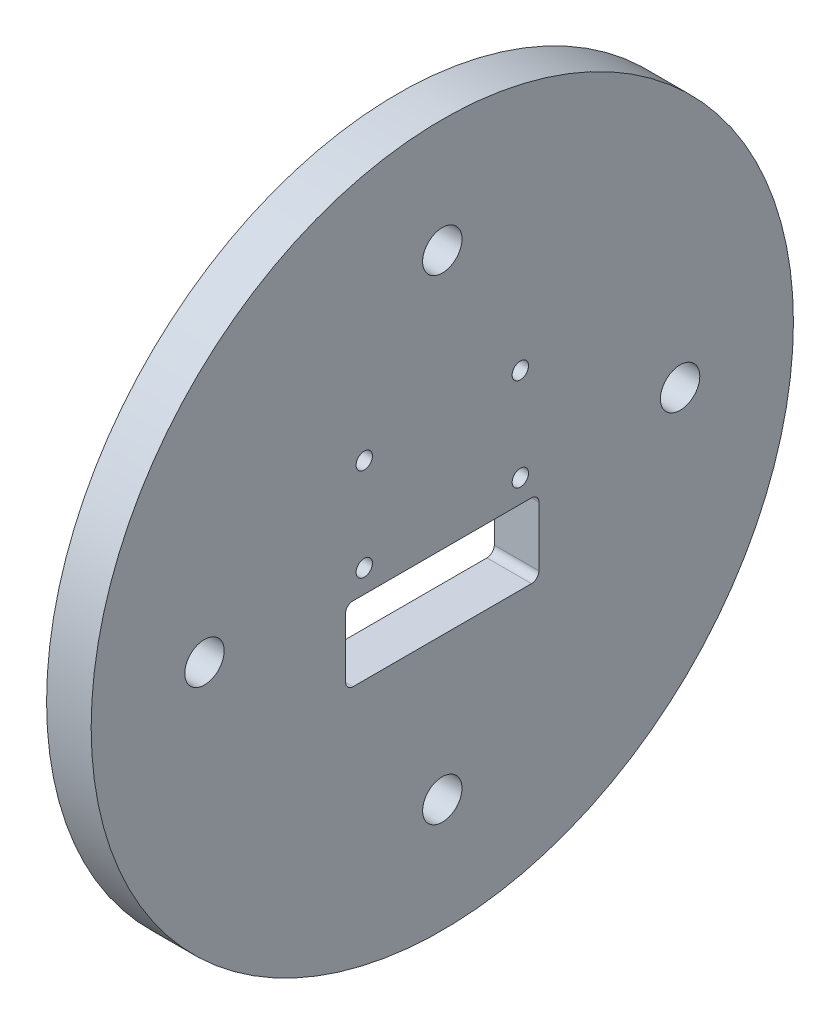
ISO-10303-21;
HEADER;
FILE_DESCRIPTION(('STEP AP214'),'2;1');
FILE_NAME('part.step','',(''),(''),'','','');
FILE_SCHEMA(('AUTOMOTIVE_DESIGN { 1 0 10303 214 1 1 1 1 }'));
ENDSEC;
DATA;
#1=APPLICATION_CONTEXT('core data for automotive mechanical design processes');
#2=APPLICATION_PROTOCOL_DEFINITION('international standard','automotive_design',2000,#1);
#3=PRODUCT_CONTEXT('',#1,'mechanical');
#4=PRODUCT('Part','Part','',(#3));
#5=PRODUCT_RELATED_PRODUCT_CATEGORY('part','',(#4));
#6=PRODUCT_DEFINITION_FORMATION('','',#4);
#7=PRODUCT_DEFINITION_CONTEXT('part definition',#1,'design');
#8=PRODUCT_DEFINITION('design','',#6,#7);
#9=PRODUCT_DEFINITION_SHAPE('','',#8);
#10=(LENGTH_UNIT() NAMED_UNIT(*) SI_UNIT(.MILLI.,.METRE.));
#11=(NAMED_UNIT(*) PLANE_ANGLE_UNIT() SI_UNIT($,.RADIAN.));
#12=(NAMED_UNIT(*) SI_UNIT($,.STERADIAN.) SOLID_ANGLE_UNIT());
#13=UNCERTAINTY_MEASURE_WITH_UNIT(LENGTH_MEASURE(1.E-05),#10,'distance_accuracy_value','');
#14=(GEOMETRIC_REPRESENTATION_CONTEXT(3) GLOBAL_UNCERTAINTY_ASSIGNED_CONTEXT((#13)) GLOBAL_UNIT_ASSIGNED_CONTEXT((#10,
#11,#12)) REPRESENTATION_CONTEXT('',''));
#15=CARTESIAN_POINT('',(0.,0.,0.));
#16=DIRECTION('',(0.,0.,1.));
#17=DIRECTION('',(1.,0.,0.));
#18=AXIS2_PLACEMENT_3D('',#15,#16,#17);
#19=CARTESIAN_POINT('',(6.,0.,0.));
#20=DIRECTION('',(-1.,0.,0.));
#21=DIRECTION('',(0.,0.,1.));
#22=AXIS2_PLACEMENT_3D('',#19,#20,#21);
#23=CYLINDRICAL_SURFACE('',#22,47.25);
#24=CARTESIAN_POINT('',(6.,0.,0.));
#25=DIRECTION('',(1.,0.,0.));
#26=DIRECTION('',(0.,0.,-1.));
#27=AXIS2_PLACEMENT_3D('',#24,#25,#26);
#28=CIRCLE('',#27,47.25);
#29=CARTESIAN_POINT('',(6.,0.,-47.25));
#30=VERTEX_POINT('',#29);
#31=EDGE_CURVE('E151',#30,#30,#28,.T.);
#32=ORIENTED_EDGE('',*,*,#31,.F.);
#33=EDGE_LOOP('',(#32));
#34=FACE_BOUND('',#33,.T.);
#35=CARTESIAN_POINT('',(0.,0.,0.));
#36=DIRECTION('',(1.,0.,0.));
#37=DIRECTION('',(0.,0.,-1.));
#38=AXIS2_PLACEMENT_3D('',#35,#36,#37);
#39=CIRCLE('',#38,47.25);
#40=CARTESIAN_POINT('',(0.,0.,-47.25));
#41=VERTEX_POINT('',#40);
#42=EDGE_CURVE('E140',#41,#41,#39,.T.);
#43=ORIENTED_EDGE('',*,*,#42,.T.);
#44=EDGE_LOOP('',(#43));
#45=FACE_BOUND('',#44,.T.);
#46=ADVANCED_FACE('F37',(#34,#45),#23,.T.);
#47=CARTESIAN_POINT('',(6.,0.,0.));
#48=DIRECTION('',(1.,0.,0.));
#49=DIRECTION('',(0.,0.,-1.));
#50=AXIS2_PLACEMENT_3D('',#47,#48,#49);
#51=PLANE('',#50);
#52=CARTESIAN_POINT('',(6.,0.,32.));
#53=DIRECTION('',(1.,0.,0.));
#54=DIRECTION('',(0.,0.,-1.));
#55=AXIS2_PLACEMENT_3D('',#52,#53,#54);
#56=CIRCLE('',#55,2.64999999999999);
#57=CARTESIAN_POINT('',(6.,0.,29.35));
#58=VERTEX_POINT('',#57);
#59=EDGE_CURVE('E206',#58,#58,#56,.T.);
#60=ORIENTED_EDGE('',*,*,#59,.F.);
#61=EDGE_LOOP('',(#60));
#62=FACE_BOUND('',#61,.T.);
#63=CARTESIAN_POINT('',(6.,32.,0.));
#64=DIRECTION('',(1.,0.,0.));
#65=DIRECTION('',(0.,0.,-1.));
#66=AXIS2_PLACEMENT_3D('',#63,#64,#65);
#67=CIRCLE('',#66,2.64999999999999);
#68=CARTESIAN_POINT('',(6.,32.,-2.64999999999998));
#69=VERTEX_POINT('',#68);
#70=EDGE_CURVE('E196',#69,#69,#67,.T.);
#71=ORIENTED_EDGE('',*,*,#70,.F.);
#72=EDGE_LOOP('',(#71));
#73=FACE_BOUND('',#72,.T.);
#74=CARTESIAN_POINT('',(6.,0.,-32.));
#75=DIRECTION('',(1.,0.,0.));
#76=DIRECTION('',(0.,0.,-1.));
#77=AXIS2_PLACEMENT_3D('',#74,#75,#76);
#78=CIRCLE('',#77,2.64999999999999);
#79=CARTESIAN_POINT('',(6.,0.,-34.65));
#80=VERTEX_POINT('',#79);
#81=EDGE_CURVE('E193',#80,#80,#78,.T.);
#82=ORIENTED_EDGE('',*,*,#81,.F.);
#83=EDGE_LOOP('',(#82));
#84=FACE_BOUND('',#83,.T.);
#85=CARTESIAN_POINT('',(6.,-32.,0.));
#86=DIRECTION('',(1.,0.,0.));
#87=DIRECTION('',(0.,0.,-1.));
#88=AXIS2_PLACEMENT_3D('',#85,#86,#87);
#89=CIRCLE('',#88,2.64999999999999);
#90=CARTESIAN_POINT('',(6.,-32.,-2.64999999999999));
#91=VERTEX_POINT('',#90);
#92=EDGE_CURVE('E190',#91,#91,#89,.T.);
#93=ORIENTED_EDGE('',*,*,#92,.F.);
#94=EDGE_LOOP('',(#93));
#95=FACE_BOUND('',#94,.T.);
#96=CARTESIAN_POINT('',(6.,12.75,10.5));
#97=DIRECTION('',(1.,0.,0.));
#98=DIRECTION('',(0.,0.,-1.));
#99=AXIS2_PLACEMENT_3D('',#96,#97,#98);
#100=CIRCLE('',#99,1.1);
#101=CARTESIAN_POINT('',(6.,12.75,9.40000000000001));
#102=VERTEX_POINT('',#101);
#103=EDGE_CURVE('E186',#102,#102,#100,.T.);
#104=ORIENTED_EDGE('',*,*,#103,.F.);
#105=EDGE_LOOP('',(#104));
#106=FACE_BOUND('',#105,.T.);
#107=CARTESIAN_POINT('',(6.,12.75,-10.5));
#108=DIRECTION('',(1.,0.,0.));
#109=DIRECTION('',(0.,0.,-1.));
#110=AXIS2_PLACEMENT_3D('',#107,#108,#109);
#111=CIRCLE('',#110,1.10000000000001);
#112=CARTESIAN_POINT('',(6.,12.75,-11.6));
#113=VERTEX_POINT('',#112);
#114=EDGE_CURVE('E182',#113,#113,#111,.T.);
#115=ORIENTED_EDGE('',*,*,#114,.F.);
#116=EDGE_LOOP('',(#115));
#117=FACE_BOUND('',#116,.T.);
#118=CARTESIAN_POINT('',(6.,0.250000000000007,-10.5));
#119=DIRECTION('',(1.,0.,0.));
#120=DIRECTION('',(0.,0.,-1.));
#121=AXIS2_PLACEMENT_3D('',#118,#119,#120);
#122=CIRCLE('',#121,1.10000000000001);
#123=CARTESIAN_POINT('',(6.,0.250000000000007,-11.6));
#124=VERTEX_POINT('',#123);
#125=EDGE_CURVE('E178',#124,#124,#122,.T.);
#126=ORIENTED_EDGE('',*,*,#125,.F.);
#127=EDGE_LOOP('',(#126));
#128=FACE_BOUND('',#127,.T.);
#129=CARTESIAN_POINT('',(6.,0.250000000000007,10.5));
#130=DIRECTION('',(1.,0.,0.));
#131=DIRECTION('',(0.,0.,-1.));
#132=AXIS2_PLACEMENT_3D('',#129,#130,#131);
#133=CIRCLE('',#132,1.1);
#134=CARTESIAN_POINT('',(6.,0.250000000000007,9.40000000000001));
#135=VERTEX_POINT('',#134);
#136=EDGE_CURVE('E174',#135,#135,#133,.T.);
#137=ORIENTED_EDGE('',*,*,#136,.F.);
#138=EDGE_LOOP('',(#137));
#139=FACE_BOUND('',#138,.T.);
#140=CARTESIAN_POINT('',(6.,-11.85,12.));
#141=DIRECTION('',(1.,0.,0.));
#142=DIRECTION('',(0.,0.,-1.));
#143=AXIS2_PLACEMENT_3D('',#140,#141,#142);
#144=CIRCLE('',#143,1.);
#145=CARTESIAN_POINT('',(6.,-12.85,12.));
#146=VERTEX_POINT('',#145);
#147=CARTESIAN_POINT('',(6.,-11.85,13.));
#148=VERTEX_POINT('',#147);
#149=EDGE_CURVE('E114',#146,#148,#144,.F.);
#150=ORIENTED_EDGE('',*,*,#149,.T.);
#151=DIRECTION('',(0.,1.,0.));
#152=VECTOR('',#151,1.);
#153=CARTESIAN_POINT('',(6.,0.,13.));
#154=LINE('',#153,#152);
#155=CARTESIAN_POINT('',(6.,-4.10000000000001,13.));
#156=VERTEX_POINT('',#155);
#157=EDGE_CURVE('E53',#148,#156,#154,.T.);
#158=ORIENTED_EDGE('',*,*,#157,.T.);
#159=CARTESIAN_POINT('',(6.,-3.84949152518986,12.0318855935127));
#160=DIRECTION('',(1.,0.,0.));
#161=DIRECTION('',(0.,0.,-1.));
#162=AXIS2_PLACEMENT_3D('',#159,#160,#161);
#163=CIRCLE('',#162,1.);
#164=CARTESIAN_POINT('',(6.,-2.85,12.));
#165=VERTEX_POINT('',#164);
#166=EDGE_CURVE('E135',#165,#156,#163,.T.);
#167=ORIENTED_EDGE('',*,*,#166,.F.);
#168=DIRECTION('',(0.,0.,-1.));
#169=VECTOR('',#168,1.);
#170=CARTESIAN_POINT('',(6.,-2.85,0.));
#171=LINE('',#170,#169);
#172=CARTESIAN_POINT('',(6.,-2.85,-12.));
#173=VERTEX_POINT('',#172);
#174=EDGE_CURVE('E132',#165,#173,#171,.T.);
#175=ORIENTED_EDGE('',*,*,#174,.T.);
#176=CARTESIAN_POINT('',(6.,-3.85,-12.));
#177=DIRECTION('',(1.,0.,0.));
#178=DIRECTION('',(0.,0.,-1.));
#179=AXIS2_PLACEMENT_3D('',#176,#177,#178);
#180=CIRCLE('',#179,0.999999999999999);
#181=CARTESIAN_POINT('',(6.,-3.85000000000001,-13.));
#182=VERTEX_POINT('',#181);
#183=EDGE_CURVE('E129',#182,#173,#180,.T.);
#184=ORIENTED_EDGE('',*,*,#183,.F.);
#185=DIRECTION('',(0.,-1.,0.));
#186=VECTOR('',#185,1.);
#187=CARTESIAN_POINT('',(6.,0.,-13.));
#188=LINE('',#187,#186);
#189=CARTESIAN_POINT('',(6.,-11.85,-13.));
#190=VERTEX_POINT('',#189);
#191=EDGE_CURVE('E124',#182,#190,#188,.T.);
#192=ORIENTED_EDGE('',*,*,#191,.T.);
#193=CARTESIAN_POINT('',(6.,-11.85,-12.));
#194=DIRECTION('',(1.,0.,0.));
#195=DIRECTION('',(0.,0.,-1.));
#196=AXIS2_PLACEMENT_3D('',#193,#194,#195);
#197=CIRCLE('',#196,1.);
#198=CARTESIAN_POINT('',(6.,-12.85,-12.));
#199=VERTEX_POINT('',#198);
#200=EDGE_CURVE('E122',#199,#190,#197,.T.);
#201=ORIENTED_EDGE('',*,*,#200,.F.);
#202=DIRECTION('',(0.,0.,1.));
#203=VECTOR('',#202,1.);
#204=CARTESIAN_POINT('',(6.,-12.85,0.));
#205=LINE('',#204,#203);
#206=EDGE_CURVE('E105',#199,#146,#205,.T.);
#207=ORIENTED_EDGE('',*,*,#206,.T.);
#208=EDGE_LOOP('',(#150,#158,#167,#175,#184,#192,#201,#207));
#209=FACE_BOUND('',#208,.T.);
#210=ORIENTED_EDGE('',*,*,#31,.T.);
#211=EDGE_LOOP('',(#210));
#212=FACE_BOUND('',#211,.T.);
#213=ADVANCED_FACE('F118',(#62,#73,#84,#95,#106,#117,#128,#139,#209,#212),#51,.T.);
#214=CARTESIAN_POINT('',(0.,0.,0.));
#215=DIRECTION('',(1.,0.,0.));
#216=DIRECTION('',(0.,0.,-1.));
#217=AXIS2_PLACEMENT_3D('',#214,#215,#216);
#218=PLANE('',#217);
#219=CARTESIAN_POINT('',(0.,0.,32.));
#220=DIRECTION('',(1.,0.,0.));
#221=DIRECTION('',(0.,0.,-1.));
#222=AXIS2_PLACEMENT_3D('',#219,#220,#221);
#223=CIRCLE('',#222,2.64999999999999);
#224=CARTESIAN_POINT('',(0.,0.,29.35));
#225=VERTEX_POINT('',#224);
#226=EDGE_CURVE('E40',#225,#225,#223,.T.);
#227=ORIENTED_EDGE('',*,*,#226,.T.);
#228=EDGE_LOOP('',(#227));
#229=FACE_BOUND('',#228,.T.);
#230=CARTESIAN_POINT('',(0.,32.,0.));
#231=DIRECTION('',(1.,0.,0.));
#232=DIRECTION('',(0.,0.,-1.));
#233=AXIS2_PLACEMENT_3D('',#230,#231,#232);
#234=CIRCLE('',#233,2.64999999999999);
#235=CARTESIAN_POINT('',(0.,32.,-2.64999999999998));
#236=VERTEX_POINT('',#235);
#237=EDGE_CURVE('E194',#236,#236,#234,.T.);
#238=ORIENTED_EDGE('',*,*,#237,.T.);
#239=EDGE_LOOP('',(#238));
#240=FACE_BOUND('',#239,.T.);
#241=CARTESIAN_POINT('',(0.,0.,-32.));
#242=DIRECTION('',(1.,0.,0.));
#243=DIRECTION('',(0.,0.,-1.));
#244=AXIS2_PLACEMENT_3D('',#241,#242,#243);
#245=CIRCLE('',#244,2.64999999999999);
#246=CARTESIAN_POINT('',(0.,0.,-34.65));
#247=VERTEX_POINT('',#246);
#248=EDGE_CURVE('E191',#247,#247,#245,.T.);
#249=ORIENTED_EDGE('',*,*,#248,.T.);
#250=EDGE_LOOP('',(#249));
#251=FACE_BOUND('',#250,.T.);
#252=CARTESIAN_POINT('',(0.,-32.,0.));
#253=DIRECTION('',(1.,0.,0.));
#254=DIRECTION('',(0.,0.,-1.));
#255=AXIS2_PLACEMENT_3D('',#252,#253,#254);
#256=CIRCLE('',#255,2.64999999999999);
#257=CARTESIAN_POINT('',(0.,-32.,-2.64999999999999));
#258=VERTEX_POINT('',#257);
#259=EDGE_CURVE('E187',#258,#258,#256,.T.);
#260=ORIENTED_EDGE('',*,*,#259,.T.);
#261=EDGE_LOOP('',(#260));
#262=FACE_BOUND('',#261,.T.);
#263=CARTESIAN_POINT('',(0.,12.75,10.5));
#264=DIRECTION('',(1.,0.,0.));
#265=DIRECTION('',(0.,0.,-1.));
#266=AXIS2_PLACEMENT_3D('',#263,#264,#265);
#267=CIRCLE('',#266,1.1);
#268=CARTESIAN_POINT('',(0.,12.75,9.40000000000001));
#269=VERTEX_POINT('',#268);
#270=EDGE_CURVE('E183',#269,#269,#267,.T.);
#271=ORIENTED_EDGE('',*,*,#270,.T.);
#272=EDGE_LOOP('',(#271));
#273=FACE_BOUND('',#272,.T.);
#274=CARTESIAN_POINT('',(0.,12.75,-10.5));
#275=DIRECTION('',(1.,0.,0.));
#276=DIRECTION('',(0.,0.,-1.));
#277=AXIS2_PLACEMENT_3D('',#274,#275,#276);
#278=CIRCLE('',#277,1.10000000000001);
#279=CARTESIAN_POINT('',(0.,12.75,-11.6));
#280=VERTEX_POINT('',#279);
#281=EDGE_CURVE('E179',#280,#280,#278,.T.);
#282=ORIENTED_EDGE('',*,*,#281,.T.);
#283=EDGE_LOOP('',(#282));
#284=FACE_BOUND('',#283,.T.);
#285=CARTESIAN_POINT('',(0.,0.250000000000007,-10.5));
#286=DIRECTION('',(1.,0.,0.));
#287=DIRECTION('',(0.,0.,-1.));
#288=AXIS2_PLACEMENT_3D('',#285,#286,#287);
#289=CIRCLE('',#288,1.10000000000001);
#290=CARTESIAN_POINT('',(0.,0.250000000000007,-11.6));
#291=VERTEX_POINT('',#290);
#292=EDGE_CURVE('E175',#291,#291,#289,.T.);
#293=ORIENTED_EDGE('',*,*,#292,.T.);
#294=EDGE_LOOP('',(#293));
#295=FACE_BOUND('',#294,.T.);
#296=CARTESIAN_POINT('',(0.,0.250000000000007,10.5));
#297=DIRECTION('',(1.,0.,0.));
#298=DIRECTION('',(0.,0.,-1.));
#299=AXIS2_PLACEMENT_3D('',#296,#297,#298);
#300=CIRCLE('',#299,1.1);
#301=CARTESIAN_POINT('',(0.,0.250000000000007,9.40000000000001));
#302=VERTEX_POINT('',#301);
#303=EDGE_CURVE('E171',#302,#302,#300,.T.);
#304=ORIENTED_EDGE('',*,*,#303,.T.);
#305=EDGE_LOOP('',(#304));
#306=FACE_BOUND('',#305,.T.);
#307=DIRECTION('',(0.,1.,0.));
#308=VECTOR('',#307,1.);
#309=CARTESIAN_POINT('',(0.,0.,13.));
#310=LINE('',#309,#308);
#311=CARTESIAN_POINT('',(0.,-11.85,13.));
#312=VERTEX_POINT('',#311);
#313=CARTESIAN_POINT('',(0.,-4.10000000000001,13.));
#314=VERTEX_POINT('',#313);
#315=EDGE_CURVE('E11',#312,#314,#310,.T.);
#316=ORIENTED_EDGE('',*,*,#315,.F.);
#317=CARTESIAN_POINT('',(0.,-11.85,12.));
#318=DIRECTION('',(1.,0.,0.));
#319=DIRECTION('',(0.,0.,-1.));
#320=AXIS2_PLACEMENT_3D('',#317,#318,#319);
#321=CIRCLE('',#320,1.);
#322=CARTESIAN_POINT('',(0.,-12.85,12.));
#323=VERTEX_POINT('',#322);
#324=EDGE_CURVE('E154',#323,#312,#321,.F.);
#325=ORIENTED_EDGE('',*,*,#324,.F.);
#326=DIRECTION('',(0.,0.,1.));
#327=VECTOR('',#326,1.);
#328=CARTESIAN_POINT('',(0.,-12.85,0.));
#329=LINE('',#328,#327);
#330=CARTESIAN_POINT('',(0.,-12.85,-12.));
#331=VERTEX_POINT('',#330);
#332=EDGE_CURVE('E108',#331,#323,#329,.T.);
#333=ORIENTED_EDGE('',*,*,#332,.F.);
#334=CARTESIAN_POINT('',(0.,-11.85,-12.));
#335=DIRECTION('',(1.,0.,0.));
#336=DIRECTION('',(0.,0.,-1.));
#337=AXIS2_PLACEMENT_3D('',#334,#335,#336);
#338=CIRCLE('',#337,1.);
#339=CARTESIAN_POINT('',(0.,-11.85,-13.));
#340=VERTEX_POINT('',#339);
#341=EDGE_CURVE('E159',#331,#340,#338,.T.);
#342=ORIENTED_EDGE('',*,*,#341,.T.);
#343=DIRECTION('',(0.,-1.,0.));
#344=VECTOR('',#343,1.);
#345=CARTESIAN_POINT('',(0.,0.,-13.));
#346=LINE('',#345,#344);
#347=CARTESIAN_POINT('',(0.,-3.85000000000001,-13.));
#348=VERTEX_POINT('',#347);
#349=EDGE_CURVE('E162',#348,#340,#346,.T.);
#350=ORIENTED_EDGE('',*,*,#349,.F.);
#351=CARTESIAN_POINT('',(0.,-3.85,-12.));
#352=DIRECTION('',(1.,0.,0.));
#353=DIRECTION('',(0.,0.,-1.));
#354=AXIS2_PLACEMENT_3D('',#351,#352,#353);
#355=CIRCLE('',#354,0.999999999999999);
#356=CARTESIAN_POINT('',(0.,-2.85,-12.));
#357=VERTEX_POINT('',#356);
#358=EDGE_CURVE('E164',#348,#357,#355,.T.);
#359=ORIENTED_EDGE('',*,*,#358,.T.);
#360=DIRECTION('',(0.,0.,-1.));
#361=VECTOR('',#360,1.);
#362=CARTESIAN_POINT('',(0.,-2.85,0.));
#363=LINE('',#362,#361);
#364=CARTESIAN_POINT('',(0.,-2.85,12.));
#365=VERTEX_POINT('',#364);
#366=EDGE_CURVE('E167',#365,#357,#363,.T.);
#367=ORIENTED_EDGE('',*,*,#366,.F.);
#368=CARTESIAN_POINT('',(0.,-3.84949152518986,12.0318855935127));
#369=DIRECTION('',(1.,0.,0.));
#370=DIRECTION('',(0.,0.,-1.));
#371=AXIS2_PLACEMENT_3D('',#368,#369,#370);
#372=CIRCLE('',#371,1.);
#373=EDGE_CURVE('E45',#365,#314,#372,.T.);
#374=ORIENTED_EDGE('',*,*,#373,.T.);
#375=EDGE_LOOP('',(#316,#325,#333,#342,#350,#359,#367,#374));
#376=FACE_BOUND('',#375,.T.);
#377=ORIENTED_EDGE('',*,*,#42,.F.);
#378=EDGE_LOOP('',(#377));
#379=FACE_BOUND('',#378,.T.);
#380=ADVANCED_FACE('F241',(#229,#240,#251,#262,#273,#284,#295,#306,#376,#379),#218,.F.);
#381=CARTESIAN_POINT('',(-14.,0.,13.));
#382=DIRECTION('',(0.,0.,-1.));
#383=DIRECTION('',(-1.,0.,0.));
#384=AXIS2_PLACEMENT_3D('',#381,#382,#383);
#385=PLANE('',#384);
#386=ORIENTED_EDGE('',*,*,#315,.T.);
#387=DIRECTION('',(1.,0.,0.));
#388=VECTOR('',#387,1.);
#389=CARTESIAN_POINT('',(-14.,-4.10000000000001,13.));
#390=LINE('',#389,#388);
#391=EDGE_CURVE('E138',#314,#156,#390,.T.);
#392=ORIENTED_EDGE('',*,*,#391,.T.);
#393=ORIENTED_EDGE('',*,*,#157,.F.);
#394=DIRECTION('',(1.,0.,0.));
#395=VECTOR('',#394,1.);
#396=CARTESIAN_POINT('',(-14.,-11.85,13.));
#397=LINE('',#396,#395);
#398=EDGE_CURVE('E111',#312,#148,#397,.T.);
#399=ORIENTED_EDGE('',*,*,#398,.F.);
#400=EDGE_LOOP('',(#386,#392,#393,#399));
#401=FACE_BOUND('',#400,.T.);
#402=ADVANCED_FACE('F243',(#401),#385,.T.);
#403=CARTESIAN_POINT('',(-14.,-3.84949152518986,12.0318855935127));
#404=DIRECTION('',(1.,0.,0.));
#405=DIRECTION('',(0.,0.,-1.));
#406=AXIS2_PLACEMENT_3D('',#403,#404,#405);
#407=CYLINDRICAL_SURFACE('',#406,1.);
#408=DIRECTION('',(1.,0.,0.));
#409=VECTOR('',#408,1.);
#410=CARTESIAN_POINT('',(-14.,-2.85,12.));
#411=LINE('',#410,#409);
#412=EDGE_CURVE('E141',#365,#165,#411,.T.);
#413=ORIENTED_EDGE('',*,*,#412,.T.);
#414=ORIENTED_EDGE('',*,*,#166,.T.);
#415=ORIENTED_EDGE('',*,*,#391,.F.);
#416=ORIENTED_EDGE('',*,*,#373,.F.);
#417=EDGE_LOOP('',(#413,#414,#415,#416));
#418=FACE_BOUND('',#417,.T.);
#419=ADVANCED_FACE('F223',(#418),#407,.F.);
#420=CARTESIAN_POINT('',(-14.,-2.85,0.));
#421=DIRECTION('',(0.,-1.,0.));
#422=DIRECTION('',(0.,0.,-1.));
#423=AXIS2_PLACEMENT_3D('',#420,#421,#422);
#424=PLANE('',#423);
#425=ORIENTED_EDGE('',*,*,#366,.T.);
#426=DIRECTION('',(1.,0.,0.));
#427=VECTOR('',#426,1.);
#428=CARTESIAN_POINT('',(-14.,-2.85,-12.));
#429=LINE('',#428,#427);
#430=EDGE_CURVE('E143',#357,#173,#429,.T.);
#431=ORIENTED_EDGE('',*,*,#430,.T.);
#432=ORIENTED_EDGE('',*,*,#174,.F.);
#433=ORIENTED_EDGE('',*,*,#412,.F.);
#434=EDGE_LOOP('',(#425,#431,#432,#433));
#435=FACE_BOUND('',#434,.T.);
#436=ADVANCED_FACE('F227',(#435),#424,.T.);
#437=CARTESIAN_POINT('',(-14.,-3.85,-12.));
#438=DIRECTION('',(1.,0.,0.));
#439=DIRECTION('',(0.,0.,-1.));
#440=AXIS2_PLACEMENT_3D('',#437,#438,#439);
#441=CYLINDRICAL_SURFACE('',#440,0.999999999999999);
#442=DIRECTION('',(1.,0.,0.));
#443=VECTOR('',#442,1.);
#444=CARTESIAN_POINT('',(-14.,-3.85000000000001,-13.));
#445=LINE('',#444,#443);
#446=EDGE_CURVE('E145',#348,#182,#445,.T.);
#447=ORIENTED_EDGE('',*,*,#446,.T.);
#448=ORIENTED_EDGE('',*,*,#183,.T.);
#449=ORIENTED_EDGE('',*,*,#430,.F.);
#450=ORIENTED_EDGE('',*,*,#358,.F.);
#451=EDGE_LOOP('',(#447,#448,#449,#450));
#452=FACE_BOUND('',#451,.T.);
#453=ADVANCED_FACE('F230',(#452),#441,.F.);
#454=CARTESIAN_POINT('',(-14.,0.,-13.));
#455=DIRECTION('',(0.,0.,1.));
#456=DIRECTION('',(0.,-1.,0.));
#457=AXIS2_PLACEMENT_3D('',#454,#455,#456);
#458=PLANE('',#457);
#459=ORIENTED_EDGE('',*,*,#349,.T.);
#460=DIRECTION('',(1.,0.,0.));
#461=VECTOR('',#460,1.);
#462=CARTESIAN_POINT('',(-14.,-11.85,-13.));
#463=LINE('',#462,#461);
#464=EDGE_CURVE('E147',#340,#190,#463,.T.);
#465=ORIENTED_EDGE('',*,*,#464,.T.);
#466=ORIENTED_EDGE('',*,*,#191,.F.);
#467=ORIENTED_EDGE('',*,*,#446,.F.);
#468=EDGE_LOOP('',(#459,#465,#466,#467));
#469=FACE_BOUND('',#468,.T.);
#470=ADVANCED_FACE('F234',(#469),#458,.T.);
#471=CARTESIAN_POINT('',(-14.,-11.85,-12.));
#472=DIRECTION('',(1.,0.,0.));
#473=DIRECTION('',(0.,0.,-1.));
#474=AXIS2_PLACEMENT_3D('',#471,#472,#473);
#475=CYLINDRICAL_SURFACE('',#474,1.);
#476=DIRECTION('',(1.,0.,0.));
#477=VECTOR('',#476,1.);
#478=CARTESIAN_POINT('',(-14.,-12.85,-12.));
#479=LINE('',#478,#477);
#480=EDGE_CURVE('E110',#331,#199,#479,.T.);
#481=ORIENTED_EDGE('',*,*,#480,.T.);
#482=ORIENTED_EDGE('',*,*,#200,.T.);
#483=ORIENTED_EDGE('',*,*,#464,.F.);
#484=ORIENTED_EDGE('',*,*,#341,.F.);
#485=EDGE_LOOP('',(#481,#482,#483,#484));
#486=FACE_BOUND('',#485,.T.);
#487=ADVANCED_FACE('F238',(#486),#475,.F.);
#488=CARTESIAN_POINT('',(-14.,-12.85,0.));
#489=DIRECTION('',(0.,1.,0.));
#490=DIRECTION('',(0.,0.,1.));
#491=AXIS2_PLACEMENT_3D('',#488,#489,#490);
#492=PLANE('',#491);
#493=ORIENTED_EDGE('',*,*,#332,.T.);
#494=DIRECTION('',(1.,0.,0.));
#495=VECTOR('',#494,1.);
#496=CARTESIAN_POINT('',(-14.,-12.85,12.));
#497=LINE('',#496,#495);
#498=EDGE_CURVE('E61',#323,#146,#497,.T.);
#499=ORIENTED_EDGE('',*,*,#498,.T.);
#500=ORIENTED_EDGE('',*,*,#206,.F.);
#501=ORIENTED_EDGE('',*,*,#480,.F.);
#502=EDGE_LOOP('',(#493,#499,#500,#501));
#503=FACE_BOUND('',#502,.T.);
#504=ADVANCED_FACE('F102',(#503),#492,.T.);
#505=CARTESIAN_POINT('',(-14.,-11.85,12.));
#506=DIRECTION('',(1.,0.,0.));
#507=DIRECTION('',(0.,0.,-1.));
#508=AXIS2_PLACEMENT_3D('',#505,#506,#507);
#509=CYLINDRICAL_SURFACE('',#508,1.);
#510=ORIENTED_EDGE('',*,*,#324,.T.);
#511=ORIENTED_EDGE('',*,*,#398,.T.);
#512=ORIENTED_EDGE('',*,*,#149,.F.);
#513=ORIENTED_EDGE('',*,*,#498,.F.);
#514=EDGE_LOOP('',(#510,#511,#512,#513));
#515=FACE_BOUND('',#514,.T.);
#516=ADVANCED_FACE('F115',(#515),#509,.F.);
#517=CARTESIAN_POINT('',(-14.,0.250000000000007,10.5));
#518=DIRECTION('',(1.,0.,0.));
#519=DIRECTION('',(0.,0.,-1.));
#520=AXIS2_PLACEMENT_3D('',#517,#518,#519);
#521=CYLINDRICAL_SURFACE('',#520,1.1);
#522=ORIENTED_EDGE('',*,*,#136,.T.);
#523=EDGE_LOOP('',(#522));
#524=FACE_BOUND('',#523,.T.);
#525=ORIENTED_EDGE('',*,*,#303,.F.);
#526=EDGE_LOOP('',(#525));
#527=FACE_BOUND('',#526,.T.);
#528=ADVANCED_FACE('F281',(#524,#527),#521,.F.);
#529=CARTESIAN_POINT('',(-14.,0.250000000000007,-10.5));
#530=DIRECTION('',(1.,0.,0.));
#531=DIRECTION('',(0.,0.,-1.));
#532=AXIS2_PLACEMENT_3D('',#529,#530,#531);
#533=CYLINDRICAL_SURFACE('',#532,1.10000000000001);
#534=ORIENTED_EDGE('',*,*,#125,.T.);
#535=EDGE_LOOP('',(#534));
#536=FACE_BOUND('',#535,.T.);
#537=ORIENTED_EDGE('',*,*,#292,.F.);
#538=EDGE_LOOP('',(#537));
#539=FACE_BOUND('',#538,.T.);
#540=ADVANCED_FACE('F284',(#536,#539),#533,.F.);
#541=CARTESIAN_POINT('',(-14.,12.75,-10.5));
#542=DIRECTION('',(1.,0.,0.));
#543=DIRECTION('',(0.,0.,-1.));
#544=AXIS2_PLACEMENT_3D('',#541,#542,#543);
#545=CYLINDRICAL_SURFACE('',#544,1.10000000000001);
#546=ORIENTED_EDGE('',*,*,#114,.T.);
#547=EDGE_LOOP('',(#546));
#548=FACE_BOUND('',#547,.T.);
#549=ORIENTED_EDGE('',*,*,#281,.F.);
#550=EDGE_LOOP('',(#549));
#551=FACE_BOUND('',#550,.T.);
#552=ADVANCED_FACE('F292',(#548,#551),#545,.F.);
#553=CARTESIAN_POINT('',(-14.,12.75,10.5));
#554=DIRECTION('',(1.,0.,0.));
#555=DIRECTION('',(0.,0.,-1.));
#556=AXIS2_PLACEMENT_3D('',#553,#554,#555);
#557=CYLINDRICAL_SURFACE('',#556,1.1);
#558=ORIENTED_EDGE('',*,*,#103,.T.);
#559=EDGE_LOOP('',(#558));
#560=FACE_BOUND('',#559,.T.);
#561=ORIENTED_EDGE('',*,*,#270,.F.);
#562=EDGE_LOOP('',(#561));
#563=FACE_BOUND('',#562,.T.);
#564=ADVANCED_FACE('F333',(#560,#563),#557,.F.);
#565=CARTESIAN_POINT('',(6.,-32.,0.));
#566=DIRECTION('',(1.,0.,0.));
#567=DIRECTION('',(0.,0.,-1.));
#568=AXIS2_PLACEMENT_3D('',#565,#566,#567);
#569=CYLINDRICAL_SURFACE('',#568,2.64999999999999);
#570=ORIENTED_EDGE('',*,*,#92,.T.);
#571=EDGE_LOOP('',(#570));
#572=FACE_BOUND('',#571,.T.);
#573=ORIENTED_EDGE('',*,*,#259,.F.);
#574=EDGE_LOOP('',(#573));
#575=FACE_BOUND('',#574,.T.);
#576=ADVANCED_FACE('F341',(#572,#575),#569,.F.);
#577=CARTESIAN_POINT('',(6.,0.,-32.));
#578=DIRECTION('',(1.,0.,0.));
#579=DIRECTION('',(0.,0.,-1.));
#580=AXIS2_PLACEMENT_3D('',#577,#578,#579);
#581=CYLINDRICAL_SURFACE('',#580,2.64999999999999);
#582=ORIENTED_EDGE('',*,*,#81,.T.);
#583=EDGE_LOOP('',(#582));
#584=FACE_BOUND('',#583,.T.);
#585=ORIENTED_EDGE('',*,*,#248,.F.);
#586=EDGE_LOOP('',(#585));
#587=FACE_BOUND('',#586,.T.);
#588=ADVANCED_FACE('F365',(#584,#587),#581,.F.);
#589=CARTESIAN_POINT('',(6.,32.,0.));
#590=DIRECTION('',(1.,0.,0.));
#591=DIRECTION('',(0.,0.,-1.));
#592=AXIS2_PLACEMENT_3D('',#589,#590,#591);
#593=CYLINDRICAL_SURFACE('',#592,2.64999999999999);
#594=ORIENTED_EDGE('',*,*,#70,.T.);
#595=EDGE_LOOP('',(#594));
#596=FACE_BOUND('',#595,.T.);
#597=ORIENTED_EDGE('',*,*,#237,.F.);
#598=EDGE_LOOP('',(#597));
#599=FACE_BOUND('',#598,.T.);
#600=ADVANCED_FACE('F375',(#596,#599),#593,.F.);
#601=CARTESIAN_POINT('',(6.,0.,32.));
#602=DIRECTION('',(1.,0.,0.));
#603=DIRECTION('',(0.,0.,-1.));
#604=AXIS2_PLACEMENT_3D('',#601,#602,#603);
#605=CYLINDRICAL_SURFACE('',#604,2.64999999999999);
#606=ORIENTED_EDGE('',*,*,#59,.T.);
#607=EDGE_LOOP('',(#606));
#608=FACE_BOUND('',#607,.T.);
#609=ORIENTED_EDGE('',*,*,#226,.F.);
#610=EDGE_LOOP('',(#609));
#611=FACE_BOUND('',#610,.T.);
#612=ADVANCED_FACE('F385',(#608,#611),#605,.F.);
#613=CLOSED_SHELL('',(#46,#213,#380,#402,#419,#436,#453,#470,#487,#504,#516,#528,#540,#552,#564,
#576,#588,#600,#612));
#614=MANIFOLD_SOLID_BREP('B2',#613);
#615=ADVANCED_BREP_SHAPE_REPRESENTATION('',(#18,#614),#14);
#616=SHAPE_DEFINITION_REPRESENTATION(#9,#615);
ENDSEC;
END-ISO-10303-21;
